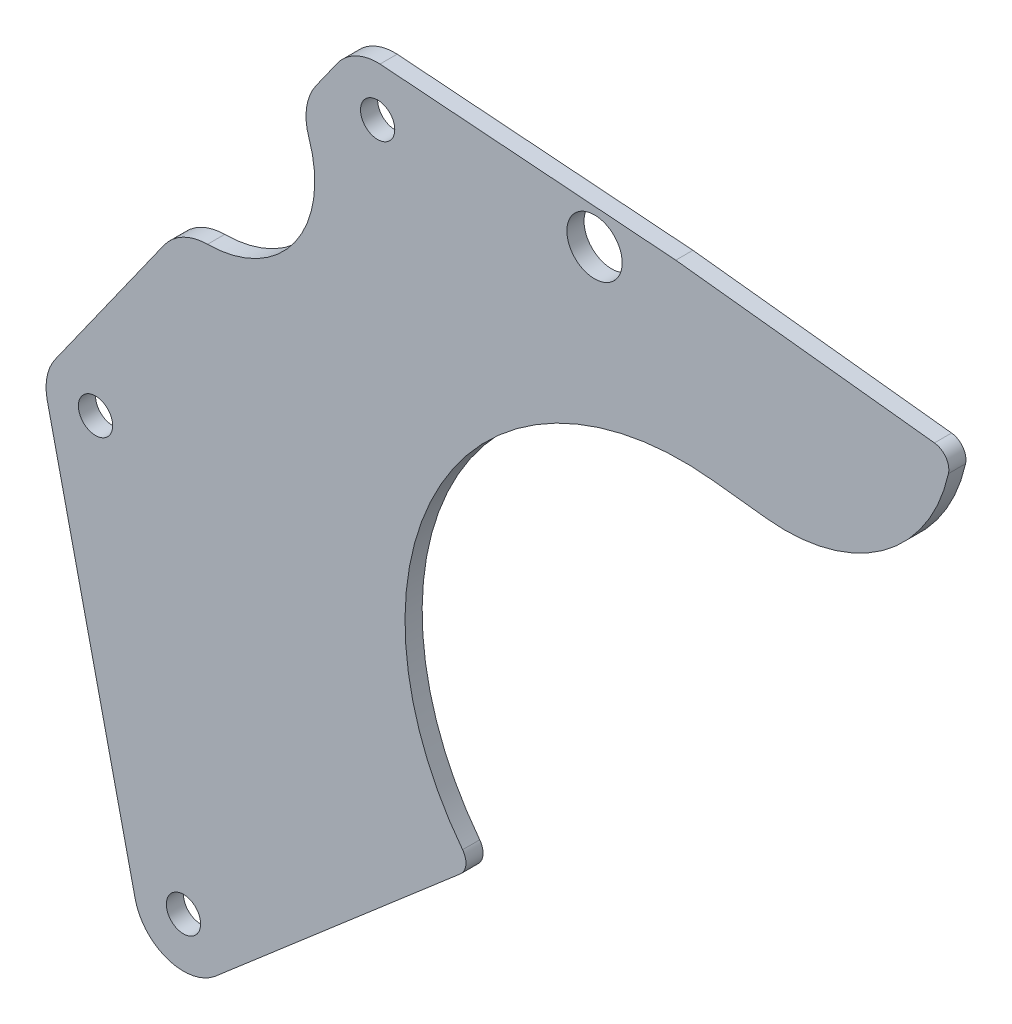
ISO-10303-21;
HEADER;
FILE_DESCRIPTION(('STEP AP214'),'2;1');
FILE_NAME('part.step','',(''),(''),'','','');
FILE_SCHEMA(('AUTOMOTIVE_DESIGN { 1 0 10303 214 1 1 1 1 }'));
ENDSEC;
DATA;
#1=APPLICATION_CONTEXT('core data for automotive mechanical design processes');
#2=APPLICATION_PROTOCOL_DEFINITION('international standard','automotive_design',2000,#1);
#3=PRODUCT_CONTEXT('',#1,'mechanical');
#4=PRODUCT('Part','Part','',(#3));
#5=PRODUCT_RELATED_PRODUCT_CATEGORY('part','',(#4));
#6=PRODUCT_DEFINITION_FORMATION('','',#4);
#7=PRODUCT_DEFINITION_CONTEXT('part definition',#1,'design');
#8=PRODUCT_DEFINITION('design','',#6,#7);
#9=PRODUCT_DEFINITION_SHAPE('','',#8);
#10=(LENGTH_UNIT() NAMED_UNIT(*) SI_UNIT(.MILLI.,.METRE.));
#11=(NAMED_UNIT(*) PLANE_ANGLE_UNIT() SI_UNIT($,.RADIAN.));
#12=(NAMED_UNIT(*) SI_UNIT($,.STERADIAN.) SOLID_ANGLE_UNIT());
#13=UNCERTAINTY_MEASURE_WITH_UNIT(LENGTH_MEASURE(1.E-05),#10,'distance_accuracy_value','');
#14=(GEOMETRIC_REPRESENTATION_CONTEXT(3) GLOBAL_UNCERTAINTY_ASSIGNED_CONTEXT((#13)) GLOBAL_UNIT_ASSIGNED_CONTEXT((#10,
#11,#12)) REPRESENTATION_CONTEXT('',''));
#15=CARTESIAN_POINT('',(0.,0.,0.));
#16=DIRECTION('',(0.,0.,1.));
#17=DIRECTION('',(1.,0.,0.));
#18=AXIS2_PLACEMENT_3D('',#15,#16,#17);
#19=CARTESIAN_POINT('',(-81.8369881821174,58.0921240925624,-3.175));
#20=DIRECTION('',(-0.815440069846838,0.578841508954034,0.));
#21=DIRECTION('',(-0.578841508954034,-0.815440069846838,0.));
#22=AXIS2_PLACEMENT_3D('',#19,#20,#21);
#23=PLANE('',#22);
#24=DIRECTION('',(-0.578841508954034,-0.815440069846838,0.));
#25=VECTOR('',#24,1.);
#26=CARTESIAN_POINT('',(-81.8369881821174,58.0921240925624,-3.175));
#27=LINE('',#26,#25);
#28=CARTESIAN_POINT('',(-63.9675027207216,83.265672028158,-3.175));
#29=VERTEX_POINT('',#28);
#30=CARTESIAN_POINT('',(-67.913524567669,77.7067335610367,-3.175));
#31=VERTEX_POINT('',#30);
#32=EDGE_CURVE('E229',#29,#31,#27,.T.);
#33=ORIENTED_EDGE('',*,*,#32,.T.);
#34=DIRECTION('',(0.,0.,1.));
#35=VECTOR('',#34,1.);
#36=CARTESIAN_POINT('',(-67.913524567669,77.7067335610367,0.));
#37=LINE('',#36,#35);
#38=CARTESIAN_POINT('',(-67.913524567669,77.7067335610367,0.));
#39=VERTEX_POINT('',#38);
#40=EDGE_CURVE('E67',#31,#39,#37,.T.);
#41=ORIENTED_EDGE('',*,*,#40,.T.);
#42=DIRECTION('',(-0.578841508954034,-0.815440069846838,0.));
#43=VECTOR('',#42,1.);
#44=CARTESIAN_POINT('',(-81.8369881821174,58.0921240925624,0.));
#45=LINE('',#44,#43);
#46=CARTESIAN_POINT('',(-63.9675027207216,83.265672028158,0.));
#47=VERTEX_POINT('',#46);
#48=EDGE_CURVE('E276',#47,#39,#45,.T.);
#49=ORIENTED_EDGE('',*,*,#48,.F.);
#50=DIRECTION('',(0.,0.,1.));
#51=VECTOR('',#50,1.);
#52=CARTESIAN_POINT('',(-63.9675027207216,83.265672028158,-3.175));
#53=LINE('',#52,#51);
#54=EDGE_CURVE('E316',#29,#47,#53,.T.);
#55=ORIENTED_EDGE('',*,*,#54,.F.);
#56=EDGE_LOOP('',(#33,#41,#49,#55));
#57=FACE_BOUND('',#56,.T.);
#58=ADVANCED_FACE('F43',(#57),#23,.T.);
#59=CARTESIAN_POINT('',(0.0073323484196218,0.0126999999984778,-3.175));
#60=DIRECTION('',(0.,0.,1.));
#61=DIRECTION('',(1.,0.,0.));
#62=AXIS2_PLACEMENT_3D('',#59,#60,#61);
#63=CYLINDRICAL_SURFACE('',#62,51.4198488537578);
#64=CARTESIAN_POINT('',(0.0073323484196218,0.0126999999984778,0.));
#65=DIRECTION('',(0.,0.,1.));
#66=DIRECTION('',(1.,0.,0.));
#67=AXIS2_PLACEMENT_3D('',#64,#65,#66);
#68=CIRCLE('',#67,51.4198488537578);
#69=CARTESIAN_POINT('',(5.71987005802179,51.1142437052494,0.));
#70=VERTEX_POINT('',#69);
#71=CARTESIAN_POINT('',(-40.7399952208334,-31.3505930686078,0.));
#72=VERTEX_POINT('',#71);
#73=EDGE_CURVE('E167',#70,#72,#68,.T.);
#74=ORIENTED_EDGE('',*,*,#73,.T.);
#75=DIRECTION('',(0.,0.,1.));
#76=VECTOR('',#75,1.);
#77=CARTESIAN_POINT('',(-40.7399952208334,-31.3505930686078,-3.175));
#78=LINE('',#77,#76);
#79=CARTESIAN_POINT('',(-40.7399952208334,-31.3505930686078,-3.175));
#80=VERTEX_POINT('',#79);
#81=EDGE_CURVE('E343',#72,#80,#78,.F.);
#82=ORIENTED_EDGE('',*,*,#81,.T.);
#83=CARTESIAN_POINT('',(0.0073323484196218,0.0126999999984778,-3.175));
#84=DIRECTION('',(0.,0.,1.));
#85=DIRECTION('',(1.,0.,0.));
#86=AXIS2_PLACEMENT_3D('',#83,#84,#85);
#87=CIRCLE('',#86,51.4198488537578);
#88=CARTESIAN_POINT('',(5.71987005802179,51.1142437052494,-3.175));
#89=VERTEX_POINT('',#88);
#90=EDGE_CURVE('E170',#89,#80,#87,.T.);
#91=ORIENTED_EDGE('',*,*,#90,.F.);
#92=DIRECTION('',(0.,0.,1.));
#93=VECTOR('',#92,1.);
#94=CARTESIAN_POINT('',(5.71987005802179,51.1142437052494,-3.175));
#95=LINE('',#94,#93);
#96=EDGE_CURVE('E164',#89,#70,#95,.T.);
#97=ORIENTED_EDGE('',*,*,#96,.T.);
#98=EDGE_LOOP('',(#74,#82,#91,#97));
#99=FACE_BOUND('',#98,.T.);
#100=ADVANCED_FACE('F166',(#99),#63,.F.);
#101=CARTESIAN_POINT('',(-0.00315637595907477,0.00366371212932346,-3.175));
#102=DIRECTION('',(-0.652702740656731,0.757614105161191,0.));
#103=DIRECTION('',(-0.757614105161192,-0.652702740656731,0.));
#104=AXIS2_PLACEMENT_3D('',#101,#102,#103);
#105=PLANE('',#104);
#106=DIRECTION('',(-0.757614105161191,-0.652702740656731,0.));
#107=VECTOR('',#106,1.);
#108=CARTESIAN_POINT('',(-0.00315637595907477,0.00366371212932346,-3.175));
#109=LINE('',#108,#107);
#110=CARTESIAN_POINT('',(-41.1592176490451,-35.4532711635278,-3.175));
#111=VERTEX_POINT('',#110);
#112=CARTESIAN_POINT('',(-86.6895047273987,-74.6787065883425,-3.175));
#113=VERTEX_POINT('',#112);
#114=EDGE_CURVE('E243',#111,#113,#109,.T.);
#115=ORIENTED_EDGE('',*,*,#114,.F.);
#116=DIRECTION('',(0.,0.,1.));
#117=VECTOR('',#116,1.);
#118=CARTESIAN_POINT('',(-41.1592176490451,-35.4532711635278,-3.175));
#119=LINE('',#118,#117);
#120=CARTESIAN_POINT('',(-41.1592176490451,-35.4532711635278,0.));
#121=VERTEX_POINT('',#120);
#122=EDGE_CURVE('E337',#111,#121,#119,.T.);
#123=ORIENTED_EDGE('',*,*,#122,.T.);
#124=DIRECTION('',(-0.757614105161191,-0.652702740656731,0.));
#125=VECTOR('',#124,1.);
#126=CARTESIAN_POINT('',(-0.00315637595907477,0.00366371212932346,0.));
#127=LINE('',#126,#125);
#128=CARTESIAN_POINT('',(-86.6895047273987,-74.6787065883425,0.));
#129=VERTEX_POINT('',#128);
#130=EDGE_CURVE('E188',#121,#129,#127,.T.);
#131=ORIENTED_EDGE('',*,*,#130,.T.);
#132=DIRECTION('',(0.,0.,1.));
#133=VECTOR('',#132,1.);
#134=CARTESIAN_POINT('',(-86.6895047273987,-74.6787065883425,-3.175));
#135=LINE('',#134,#133);
#136=EDGE_CURVE('E177',#113,#129,#135,.T.);
#137=ORIENTED_EDGE('',*,*,#136,.F.);
#138=EDGE_LOOP('',(#115,#123,#131,#137));
#139=FACE_BOUND('',#138,.T.);
#140=ADVANCED_FACE('F434',(#139),#105,.F.);
#141=CARTESIAN_POINT('',(-92.4756552296519,-67.558236985483,-3.175));
#142=DIRECTION('',(0.,0.,1.));
#143=DIRECTION('',(1.,0.,0.));
#144=AXIS2_PLACEMENT_3D('',#141,#142,#143);
#145=CYLINDRICAL_SURFACE('',#144,9.17499999999842);
#146=CARTESIAN_POINT('',(-92.4756552296519,-67.558236985483,0.));
#147=DIRECTION('',(0.,0.,1.));
#148=DIRECTION('',(1.,0.,0.));
#149=AXIS2_PLACEMENT_3D('',#146,#147,#148);
#150=CIRCLE('',#149,9.17499999999842);
#151=CARTESIAN_POINT('',(-101.423346554441,-69.5878785686907,0.));
#152=VERTEX_POINT('',#151);
#153=EDGE_CURVE('E287',#152,#129,#150,.T.);
#154=ORIENTED_EDGE('',*,*,#153,.F.);
#155=DIRECTION('',(0.,0.,1.));
#156=VECTOR('',#155,1.);
#157=CARTESIAN_POINT('',(-101.423346554441,-69.5878785686907,-3.175));
#158=LINE('',#157,#156);
#159=CARTESIAN_POINT('',(-101.423346554441,-69.5878785686907,-3.175));
#160=VERTEX_POINT('',#159);
#161=EDGE_CURVE('E306',#160,#152,#158,.T.);
#162=ORIENTED_EDGE('',*,*,#161,.F.);
#163=CARTESIAN_POINT('',(-92.4756552296519,-67.558236985483,-3.175));
#164=DIRECTION('',(0.,0.,1.));
#165=DIRECTION('',(1.,0.,0.));
#166=AXIS2_PLACEMENT_3D('',#163,#164,#165);
#167=CIRCLE('',#166,9.17499999999842);
#168=EDGE_CURVE('E239',#160,#113,#167,.T.);
#169=ORIENTED_EDGE('',*,*,#168,.T.);
#170=ORIENTED_EDGE('',*,*,#136,.T.);
#171=EDGE_LOOP('',(#154,#162,#169,#170));
#172=FACE_BOUND('',#171,.T.);
#173=ADVANCED_FACE('F446',(#172),#145,.T.);
#174=CARTESIAN_POINT('',(-111.472573185204,-25.2857817409333,-3.175));
#175=DIRECTION('',(0.975225212511119,0.221214341494044,0.));
#176=DIRECTION('',(-0.221214341494044,0.975225212511119,0.));
#177=AXIS2_PLACEMENT_3D('',#174,#175,#176);
#178=PLANE('',#177);
#179=DIRECTION('',(-0.221214341494044,0.975225212511119,0.));
#180=VECTOR('',#179,1.);
#181=CARTESIAN_POINT('',(-111.472573185204,-25.2857817409333,0.));
#182=LINE('',#181,#180);
#183=CARTESIAN_POINT('',(-117.721858194137,2.26424173276732,0.));
#184=VERTEX_POINT('',#183);
#185=EDGE_CURVE('E283',#152,#184,#182,.T.);
#186=ORIENTED_EDGE('',*,*,#185,.T.);
#187=DIRECTION('',(0.,0.,1.));
#188=VECTOR('',#187,1.);
#189=CARTESIAN_POINT('',(-117.721858194137,2.26424173276732,-3.175));
#190=LINE('',#189,#188);
#191=CARTESIAN_POINT('',(-117.721858194137,2.26424173276732,-3.175));
#192=VERTEX_POINT('',#191);
#193=EDGE_CURVE('E309',#192,#184,#190,.T.);
#194=ORIENTED_EDGE('',*,*,#193,.F.);
#195=DIRECTION('',(-0.221214341494044,0.975225212511119,0.));
#196=VECTOR('',#195,1.);
#197=CARTESIAN_POINT('',(-111.472573185204,-25.2857817409333,-3.175));
#198=LINE('',#197,#196);
#199=EDGE_CURVE('E236',#160,#192,#198,.T.);
#200=ORIENTED_EDGE('',*,*,#199,.F.);
#201=ORIENTED_EDGE('',*,*,#161,.T.);
#202=EDGE_LOOP('',(#186,#194,#200,#201));
#203=FACE_BOUND('',#202,.T.);
#204=ADVANCED_FACE('F421',(#203),#178,.F.);
#205=CARTESIAN_POINT('',(-108.774166869348,4.293883315975,-3.175));
#206=DIRECTION('',(0.,0.,1.));
#207=DIRECTION('',(1.,0.,0.));
#208=AXIS2_PLACEMENT_3D('',#205,#206,#207);
#209=CYLINDRICAL_SURFACE('',#208,9.17499999999842);
#210=CARTESIAN_POINT('',(-108.774166869348,4.293883315975,0.));
#211=DIRECTION('',(0.,0.,1.));
#212=DIRECTION('',(1.,0.,0.));
#213=AXIS2_PLACEMENT_3D('',#210,#211,#212);
#214=CIRCLE('',#213,9.17499999999842);
#215=CARTESIAN_POINT('',(-116.255829510192,9.6047541606278,0.));
#216=VERTEX_POINT('',#215);
#217=EDGE_CURVE('E279',#216,#184,#214,.T.);
#218=ORIENTED_EDGE('',*,*,#217,.F.);
#219=DIRECTION('',(0.,0.,1.));
#220=VECTOR('',#219,1.);
#221=CARTESIAN_POINT('',(-116.255829510192,9.6047541606278,-3.175));
#222=LINE('',#221,#220);
#223=CARTESIAN_POINT('',(-116.255829510192,9.6047541606278,-3.175));
#224=VERTEX_POINT('',#223);
#225=EDGE_CURVE('E312',#224,#216,#222,.T.);
#226=ORIENTED_EDGE('',*,*,#225,.F.);
#227=CARTESIAN_POINT('',(-108.774166869348,4.293883315975,-3.175));
#228=DIRECTION('',(0.,0.,1.));
#229=DIRECTION('',(1.,0.,0.));
#230=AXIS2_PLACEMENT_3D('',#227,#228,#229);
#231=CIRCLE('',#230,9.17499999999842);
#232=EDGE_CURVE('E232',#224,#192,#231,.T.);
#233=ORIENTED_EDGE('',*,*,#232,.T.);
#234=ORIENTED_EDGE('',*,*,#193,.T.);
#235=EDGE_LOOP('',(#218,#226,#233,#234));
#236=FACE_BOUND('',#235,.T.);
#237=ADVANCED_FACE('F416',(#236),#209,.T.);
#238=CARTESIAN_POINT('',(-96.1120634913359,37.982183414237,0.));
#239=VERTEX_POINT('',#238);
#240=EDGE_CURVE('E275',#239,#216,#45,.T.);
#241=ORIENTED_EDGE('',*,*,#240,.F.);
#242=DIRECTION('',(0.,0.,1.));
#243=VECTOR('',#242,1.);
#244=CARTESIAN_POINT('',(-96.1120634913359,37.982183414237,-3.175));
#245=LINE('',#244,#243);
#246=CARTESIAN_POINT('',(-96.1120634913359,37.982183414237,-3.175));
#247=VERTEX_POINT('',#246);
#248=EDGE_CURVE('E11',#239,#247,#245,.F.);
#249=ORIENTED_EDGE('',*,*,#248,.T.);
#250=EDGE_CURVE('E228',#247,#224,#27,.T.);
#251=ORIENTED_EDGE('',*,*,#250,.T.);
#252=ORIENTED_EDGE('',*,*,#225,.T.);
#253=EDGE_LOOP('',(#241,#249,#251,#252));
#254=FACE_BOUND('',#253,.T.);
#255=ADVANCED_FACE('F410',(#254),#23,.T.);
#256=CARTESIAN_POINT('',(-56.4858400798775,77.9548011835051,-3.175));
#257=DIRECTION('',(0.,0.,1.));
#258=DIRECTION('',(1.,0.,0.));
#259=AXIS2_PLACEMENT_3D('',#256,#257,#258);
#260=CYLINDRICAL_SURFACE('',#259,9.17499999999841);
#261=CARTESIAN_POINT('',(-56.4858400798775,77.9548011835051,0.));
#262=DIRECTION('',(0.,0.,1.));
#263=DIRECTION('',(1.,0.,0.));
#264=AXIS2_PLACEMENT_3D('',#261,#262,#263);
#265=CIRCLE('',#264,9.17499999999841);
#266=CARTESIAN_POINT('',(-56.039685463714,87.1189471370829,0.));
#267=VERTEX_POINT('',#266);
#268=EDGE_CURVE('E271',#267,#47,#265,.T.);
#269=ORIENTED_EDGE('',*,*,#268,.F.);
#270=DIRECTION('',(0.,0.,1.));
#271=VECTOR('',#270,1.);
#272=CARTESIAN_POINT('',(-56.039685463714,87.1189471370829,-3.175));
#273=LINE('',#272,#271);
#274=CARTESIAN_POINT('',(-56.039685463714,87.1189471370829,-3.175));
#275=VERTEX_POINT('',#274);
#276=EDGE_CURVE('E319',#275,#267,#273,.T.);
#277=ORIENTED_EDGE('',*,*,#276,.F.);
#278=CARTESIAN_POINT('',(-56.4858400798775,77.9548011835051,-3.175));
#279=DIRECTION('',(0.,0.,1.));
#280=DIRECTION('',(1.,0.,0.));
#281=AXIS2_PLACEMENT_3D('',#278,#279,#280);
#282=CIRCLE('',#281,9.17499999999841);
#283=EDGE_CURVE('E224',#275,#29,#282,.T.);
#284=ORIENTED_EDGE('',*,*,#283,.T.);
#285=ORIENTED_EDGE('',*,*,#54,.T.);
#286=EDGE_LOOP('',(#269,#277,#284,#285));
#287=FACE_BOUND('',#286,.T.);
#288=ADVANCED_FACE('F386',(#287),#260,.T.);
#289=CARTESIAN_POINT('',(6.13658667931134,82.493747083869,-3.175));
#290=DIRECTION('',(-0.0741835372646384,-0.997244605299475,0.));
#291=DIRECTION('',(0.997244605299475,-0.0741835372646384,0.));
#292=AXIS2_PLACEMENT_3D('',#289,#290,#291);
#293=PLANE('',#292);
#294=DIRECTION('',(0.997244605299475,-0.0741835372646384,0.));
#295=VECTOR('',#294,1.);
#296=CARTESIAN_POINT('',(6.13658667931134,82.493747083869,0.));
#297=LINE('',#296,#295);
#298=CARTESIAN_POINT('',(-1.22605759265222,83.0414431985564,0.));
#299=VERTEX_POINT('',#298);
#300=EDGE_CURVE('E268',#267,#299,#297,.T.);
#301=ORIENTED_EDGE('',*,*,#300,.T.);
#302=DIRECTION('',(0.,0.,1.));
#303=VECTOR('',#302,1.);
#304=CARTESIAN_POINT('',(-1.22605759265222,83.0414431985564,-3.175));
#305=LINE('',#304,#303);
#306=CARTESIAN_POINT('',(-1.22605759265222,83.0414431985564,-3.175));
#307=VERTEX_POINT('',#306);
#308=EDGE_CURVE('E260',#307,#299,#305,.T.);
#309=ORIENTED_EDGE('',*,*,#308,.F.);
#310=DIRECTION('',(0.997244605299475,-0.0741835372646384,0.));
#311=VECTOR('',#310,1.);
#312=CARTESIAN_POINT('',(6.13658667931134,82.493747083869,-3.175));
#313=LINE('',#312,#311);
#314=EDGE_CURVE('E221',#275,#307,#313,.T.);
#315=ORIENTED_EDGE('',*,*,#314,.F.);
#316=ORIENTED_EDGE('',*,*,#276,.T.);
#317=EDGE_LOOP('',(#301,#309,#315,#316));
#318=FACE_BOUND('',#317,.T.);
#319=ADVANCED_FACE('F392',(#318),#293,.F.);
#320=CARTESIAN_POINT('',(-108.774166869348,4.293883315975,-3.175));
#321=DIRECTION('',(0.,0.,1.));
#322=DIRECTION('',(1.,0.,0.));
#323=AXIS2_PLACEMENT_3D('',#320,#321,#322);
#324=CYLINDRICAL_SURFACE('',#323,3.17499999999841);
#325=CARTESIAN_POINT('',(-108.774166869348,4.293883315975,-3.175));
#326=DIRECTION('',(0.,0.,1.));
#327=DIRECTION('',(1.,0.,0.));
#328=AXIS2_PLACEMENT_3D('',#325,#326,#327);
#329=CIRCLE('',#328,3.17499999999841);
#330=CARTESIAN_POINT('',(-105.59916686935,4.293883315975,-3.175));
#331=VERTEX_POINT('',#330);
#332=EDGE_CURVE('E252',#331,#331,#329,.T.);
#333=ORIENTED_EDGE('',*,*,#332,.F.);
#334=EDGE_LOOP('',(#333));
#335=FACE_BOUND('',#334,.T.);
#336=CARTESIAN_POINT('',(-108.774166869348,4.293883315975,0.));
#337=DIRECTION('',(0.,0.,1.));
#338=DIRECTION('',(1.,0.,0.));
#339=AXIS2_PLACEMENT_3D('',#336,#337,#338);
#340=CIRCLE('',#339,3.17499999999841);
#341=CARTESIAN_POINT('',(-105.59916686935,4.293883315975,0.));
#342=VERTEX_POINT('',#341);
#343=EDGE_CURVE('E296',#342,#342,#340,.T.);
#344=ORIENTED_EDGE('',*,*,#343,.T.);
#345=EDGE_LOOP('',(#344));
#346=FACE_BOUND('',#345,.T.);
#347=ADVANCED_FACE('F458',(#335,#346),#324,.F.);
#348=CARTESIAN_POINT('',(-92.4756552296519,-67.558236985483,-3.175));
#349=DIRECTION('',(0.,0.,1.));
#350=DIRECTION('',(1.,0.,0.));
#351=AXIS2_PLACEMENT_3D('',#348,#349,#350);
#352=CYLINDRICAL_SURFACE('',#351,3.17499999999842);
#353=CARTESIAN_POINT('',(-92.4756552296519,-67.558236985483,-3.175));
#354=DIRECTION('',(0.,0.,1.));
#355=DIRECTION('',(1.,0.,0.));
#356=AXIS2_PLACEMENT_3D('',#353,#354,#355);
#357=CIRCLE('',#356,3.17499999999842);
#358=CARTESIAN_POINT('',(-89.3006552296535,-67.558236985483,-3.175));
#359=VERTEX_POINT('',#358);
#360=EDGE_CURVE('E248',#359,#359,#357,.T.);
#361=ORIENTED_EDGE('',*,*,#360,.F.);
#362=EDGE_LOOP('',(#361));
#363=FACE_BOUND('',#362,.T.);
#364=CARTESIAN_POINT('',(-92.4756552296519,-67.558236985483,0.));
#365=DIRECTION('',(0.,0.,1.));
#366=DIRECTION('',(1.,0.,0.));
#367=AXIS2_PLACEMENT_3D('',#364,#365,#366);
#368=CIRCLE('',#367,3.17499999999842);
#369=CARTESIAN_POINT('',(-89.3006552296535,-67.558236985483,0.));
#370=VERTEX_POINT('',#369);
#371=EDGE_CURVE('E187',#370,#370,#368,.T.);
#372=ORIENTED_EDGE('',*,*,#371,.T.);
#373=EDGE_LOOP('',(#372));
#374=FACE_BOUND('',#373,.T.);
#375=ADVANCED_FACE('F455',(#363,#374),#352,.F.);
#376=CARTESIAN_POINT('',(9.15332765430292,81.8811528173555,-3.175));
#377=DIRECTION('',(-0.111095964631267,-0.993809683310969,0.));
#378=DIRECTION('',(0.993809683310969,-0.111095964631267,0.));
#379=AXIS2_PLACEMENT_3D('',#376,#377,#378);
#380=PLANE('',#379);
#381=DIRECTION('',(0.993809683310969,-0.111095964631267,0.));
#382=VECTOR('',#381,1.);
#383=CARTESIAN_POINT('',(9.15332765430292,81.8811528173555,0.));
#384=LINE('',#383,#382);
#385=CARTESIAN_POINT('',(46.7216683378149,77.681464368028,0.));
#386=VERTEX_POINT('',#385);
#387=EDGE_CURVE('E264',#299,#386,#384,.T.);
#388=ORIENTED_EDGE('',*,*,#387,.T.);
#389=DIRECTION('',(0.,0.,-1.));
#390=VECTOR('',#389,1.);
#391=CARTESIAN_POINT('',(46.7216683378149,77.681464368028,-3.175));
#392=LINE('',#391,#390);
#393=CARTESIAN_POINT('',(46.7216683378149,77.681464368028,-3.175));
#394=VERTEX_POINT('',#393);
#395=EDGE_CURVE('E331',#386,#394,#392,.T.);
#396=ORIENTED_EDGE('',*,*,#395,.T.);
#397=DIRECTION('',(0.993809683310969,-0.111095964631267,0.));
#398=VECTOR('',#397,1.);
#399=CARTESIAN_POINT('',(9.15332765430292,81.8811528173555,-3.175));
#400=LINE('',#399,#398);
#401=EDGE_CURVE('E216',#307,#394,#400,.T.);
#402=ORIENTED_EDGE('',*,*,#401,.F.);
#403=ORIENTED_EDGE('',*,*,#308,.T.);
#404=EDGE_LOOP('',(#388,#396,#402,#403));
#405=FACE_BOUND('',#404,.T.);
#406=ADVANCED_FACE('F396',(#405),#380,.F.);
#407=CARTESIAN_POINT('',(-16.2857242010293,77.6467656296303,-3.175));
#408=DIRECTION('',(0.,0.,1.));
#409=DIRECTION('',(1.,0.,0.));
#410=AXIS2_PLACEMENT_3D('',#407,#408,#409);
#411=CYLINDRICAL_SURFACE('',#410,5.12499999999842);
#412=CARTESIAN_POINT('',(-16.2857242010293,77.6467656296303,-3.175));
#413=DIRECTION('',(0.,0.,1.));
#414=DIRECTION('',(1.,0.,0.));
#415=AXIS2_PLACEMENT_3D('',#412,#413,#414);
#416=CIRCLE('',#415,5.12499999999842);
#417=CARTESIAN_POINT('',(-11.1607242010309,77.6467656296303,-3.175));
#418=VERTEX_POINT('',#417);
#419=EDGE_CURVE('E212',#418,#418,#416,.T.);
#420=ORIENTED_EDGE('',*,*,#419,.F.);
#421=EDGE_LOOP('',(#420));
#422=FACE_BOUND('',#421,.T.);
#423=CARTESIAN_POINT('',(-16.2857242010293,77.6467656296303,0.));
#424=DIRECTION('',(0.,0.,1.));
#425=DIRECTION('',(1.,0.,0.));
#426=AXIS2_PLACEMENT_3D('',#423,#424,#425);
#427=CIRCLE('',#426,5.12499999999842);
#428=CARTESIAN_POINT('',(-11.1607242010309,77.6467656296303,0.));
#429=VERTEX_POINT('',#428);
#430=EDGE_CURVE('E211',#429,#429,#427,.T.);
#431=ORIENTED_EDGE('',*,*,#430,.T.);
#432=EDGE_LOOP('',(#431));
#433=FACE_BOUND('',#432,.T.);
#434=ADVANCED_FACE('F466',(#422,#433),#411,.F.);
#435=CARTESIAN_POINT('',(-56.4858400798775,77.9548011835051,-3.175));
#436=DIRECTION('',(0.,0.,1.));
#437=DIRECTION('',(1.,0.,0.));
#438=AXIS2_PLACEMENT_3D('',#435,#436,#437);
#439=CYLINDRICAL_SURFACE('',#438,3.17499999999841);
#440=CARTESIAN_POINT('',(-56.4858400798775,77.9548011835051,-3.175));
#441=DIRECTION('',(0.,0.,1.));
#442=DIRECTION('',(1.,0.,0.));
#443=AXIS2_PLACEMENT_3D('',#440,#441,#442);
#444=CIRCLE('',#443,3.17499999999841);
#445=CARTESIAN_POINT('',(-53.3108400798791,77.9548011835051,-3.175));
#446=VERTEX_POINT('',#445);
#447=EDGE_CURVE('E256',#446,#446,#444,.T.);
#448=ORIENTED_EDGE('',*,*,#447,.F.);
#449=EDGE_LOOP('',(#448));
#450=FACE_BOUND('',#449,.T.);
#451=CARTESIAN_POINT('',(-56.4858400798775,77.9548011835051,0.));
#452=DIRECTION('',(0.,0.,1.));
#453=DIRECTION('',(1.,0.,0.));
#454=AXIS2_PLACEMENT_3D('',#451,#452,#453);
#455=CIRCLE('',#454,3.17499999999841);
#456=CARTESIAN_POINT('',(-53.3108400798791,77.9548011835051,0.));
#457=VERTEX_POINT('',#456);
#458=EDGE_CURVE('E217',#457,#457,#455,.T.);
#459=ORIENTED_EDGE('',*,*,#458,.T.);
#460=EDGE_LOOP('',(#459));
#461=FACE_BOUND('',#460,.T.);
#462=ADVANCED_FACE('F463',(#450,#461),#439,.F.);
#463=CARTESIAN_POINT('',(0.,0.,-3.175));
#464=DIRECTION('',(0.,0.,1.));
#465=DIRECTION('',(1.,0.,0.));
#466=AXIS2_PLACEMENT_3D('',#463,#464,#465);
#467=PLANE('',#466);
#468=ORIENTED_EDGE('',*,*,#419,.T.);
#469=EDGE_LOOP('',(#468));
#470=FACE_BOUND('',#469,.T.);
#471=CARTESIAN_POINT('',(-88.139089590994,62.1932197249627,-3.175));
#472=DIRECTION('',(0.,0.,-1.));
#473=DIRECTION('',(-1.,0.,0.));
#474=AXIS2_PLACEMENT_3D('',#471,#472,#473);
#475=CIRCLE('',#474,20.);
#476=CARTESIAN_POINT('',(-69.2191124431317,68.6766188893185,-3.175));
#477=VERTEX_POINT('',#476);
#478=CARTESIAN_POINT('',(-88.018138392243,42.1935854581187,-3.175));
#479=VERTEX_POINT('',#478);
#480=EDGE_CURVE('E196',#477,#479,#475,.T.);
#481=ORIENTED_EDGE('',*,*,#480,.F.);
#482=CARTESIAN_POINT('',(-59.7591238692006,71.9183184714964,-3.175));
#483=DIRECTION('',(0.,0.,1.));
#484=DIRECTION('',(1.,0.,0.));
#485=AXIS2_PLACEMENT_3D('',#482,#483,#484);
#486=CIRCLE('',#485,10.);
#487=EDGE_CURVE('E364',#477,#31,#486,.F.);
#488=ORIENTED_EDGE('',*,*,#487,.T.);
#489=ORIENTED_EDGE('',*,*,#32,.F.);
#490=ORIENTED_EDGE('',*,*,#283,.F.);
#491=ORIENTED_EDGE('',*,*,#314,.T.);
#492=ORIENTED_EDGE('',*,*,#401,.T.);
#493=CARTESIAN_POINT('',(46.3883804439211,74.7000353180951,-3.175));
#494=DIRECTION('',(0.,0.,1.));
#495=DIRECTION('',(1.,0.,0.));
#496=AXIS2_PLACEMENT_3D('',#493,#494,#495);
#497=CIRCLE('',#496,3.);
#498=CARTESIAN_POINT('',(49.3168322266116,74.0487518495062,-3.175));
#499=VERTEX_POINT('',#498);
#500=EDGE_CURVE('E334',#394,#499,#497,.F.);
#501=ORIENTED_EDGE('',*,*,#500,.T.);
#502=CARTESIAN_POINT('',(19.0972641529712,80.7695403666989,-3.175));
#503=DIRECTION('',(0.,0.,1.));
#504=DIRECTION('',(1.,0.,0.));
#505=AXIS2_PLACEMENT_3D('',#502,#503,#504);
#506=CIRCLE('',#505,30.957895484839);
#507=CARTESIAN_POINT('',(15.6579668911291,50.003284058937,-3.175));
#508=VERTEX_POINT('',#507);
#509=EDGE_CURVE('E204',#499,#508,#506,.F.);
#510=ORIENTED_EDGE('',*,*,#509,.T.);
#511=DIRECTION('',(-0.993809683310969,0.111095964631265,0.));
#512=VECTOR('',#511,1.);
#513=CARTESIAN_POINT('',(5.71403039246068,51.1148965095936,-3.175));
#514=LINE('',#513,#512);
#515=EDGE_CURVE('E208',#508,#89,#514,.T.);
#516=ORIENTED_EDGE('',*,*,#515,.T.);
#517=ORIENTED_EDGE('',*,*,#90,.T.);
#518=CARTESIAN_POINT('',(-43.1173258710153,-33.1804288480442,-3.175));
#519=DIRECTION('',(0.,0.,1.));
#520=DIRECTION('',(1.,0.,0.));
#521=AXIS2_PLACEMENT_3D('',#518,#519,#520);
#522=CIRCLE('',#521,3.);
#523=EDGE_CURVE('E346',#80,#111,#522,.F.);
#524=ORIENTED_EDGE('',*,*,#523,.T.);
#525=ORIENTED_EDGE('',*,*,#114,.T.);
#526=ORIENTED_EDGE('',*,*,#168,.F.);
#527=ORIENTED_EDGE('',*,*,#199,.T.);
#528=ORIENTED_EDGE('',*,*,#232,.F.);
#529=ORIENTED_EDGE('',*,*,#250,.F.);
#530=CARTESIAN_POINT('',(-87.9576627928675,32.1937683246967,-3.175));
#531=DIRECTION('',(0.,0.,1.));
#532=DIRECTION('',(1.,0.,0.));
#533=AXIS2_PLACEMENT_3D('',#530,#531,#532);
#534=CIRCLE('',#533,10.);
#535=EDGE_CURVE('E361',#247,#479,#534,.F.);
#536=ORIENTED_EDGE('',*,*,#535,.T.);
#537=EDGE_LOOP('',(#481,#488,#489,#490,#491,#492,#501,#510,#516,#517,#524,#525,#526,#527,#528,
#529,#536));
#538=FACE_BOUND('',#537,.T.);
#539=ORIENTED_EDGE('',*,*,#360,.T.);
#540=EDGE_LOOP('',(#539));
#541=FACE_BOUND('',#540,.T.);
#542=ORIENTED_EDGE('',*,*,#332,.T.);
#543=EDGE_LOOP('',(#542));
#544=FACE_BOUND('',#543,.T.);
#545=ORIENTED_EDGE('',*,*,#447,.T.);
#546=EDGE_LOOP('',(#545));
#547=FACE_BOUND('',#546,.T.);
#548=ADVANCED_FACE('F381',(#470,#538,#541,#544,#547),#467,.F.);
#549=CARTESIAN_POINT('',(0.,0.,0.));
#550=DIRECTION('',(0.,0.,1.));
#551=DIRECTION('',(1.,0.,0.));
#552=AXIS2_PLACEMENT_3D('',#549,#550,#551);
#553=PLANE('',#552);
#554=ORIENTED_EDGE('',*,*,#48,.T.);
#555=CARTESIAN_POINT('',(-59.7591238692006,71.9183184714964,0.));
#556=DIRECTION('',(0.,0.,1.));
#557=DIRECTION('',(1.,0.,0.));
#558=AXIS2_PLACEMENT_3D('',#555,#556,#557);
#559=CIRCLE('',#558,10.);
#560=CARTESIAN_POINT('',(-69.2191124431317,68.6766188893185,0.));
#561=VERTEX_POINT('',#560);
#562=EDGE_CURVE('E52',#39,#561,#559,.T.);
#563=ORIENTED_EDGE('',*,*,#562,.T.);
#564=CARTESIAN_POINT('',(-88.139089590994,62.1932197249627,0.));
#565=DIRECTION('',(0.,0.,1.));
#566=DIRECTION('',(1.,0.,0.));
#567=AXIS2_PLACEMENT_3D('',#564,#565,#566);
#568=CIRCLE('',#567,20.);
#569=CARTESIAN_POINT('',(-88.018138392243,42.1935854581187,0.));
#570=VERTEX_POINT('',#569);
#571=EDGE_CURVE('E349',#570,#561,#568,.T.);
#572=ORIENTED_EDGE('',*,*,#571,.F.);
#573=CARTESIAN_POINT('',(-87.9576627928675,32.1937683246967,0.));
#574=DIRECTION('',(0.,0.,1.));
#575=DIRECTION('',(1.,0.,0.));
#576=AXIS2_PLACEMENT_3D('',#573,#574,#575);
#577=CIRCLE('',#576,10.);
#578=EDGE_CURVE('E59',#570,#239,#577,.T.);
#579=ORIENTED_EDGE('',*,*,#578,.T.);
#580=ORIENTED_EDGE('',*,*,#240,.T.);
#581=ORIENTED_EDGE('',*,*,#217,.T.);
#582=ORIENTED_EDGE('',*,*,#185,.F.);
#583=ORIENTED_EDGE('',*,*,#153,.T.);
#584=ORIENTED_EDGE('',*,*,#130,.F.);
#585=CARTESIAN_POINT('',(-43.1173258710153,-33.1804288480442,0.));
#586=DIRECTION('',(0.,0.,1.));
#587=DIRECTION('',(1.,0.,0.));
#588=AXIS2_PLACEMENT_3D('',#585,#586,#587);
#589=CIRCLE('',#588,3.);
#590=EDGE_CURVE('E185',#121,#72,#589,.T.);
#591=ORIENTED_EDGE('',*,*,#590,.T.);
#592=ORIENTED_EDGE('',*,*,#73,.F.);
#593=DIRECTION('',(0.993809683310969,-0.111095964631265,0.));
#594=VECTOR('',#593,1.);
#595=CARTESIAN_POINT('',(5.71403039246068,51.1148965095936,0.));
#596=LINE('',#595,#594);
#597=CARTESIAN_POINT('',(15.6579668911291,50.003284058937,0.));
#598=VERTEX_POINT('',#597);
#599=EDGE_CURVE('E183',#70,#598,#596,.T.);
#600=ORIENTED_EDGE('',*,*,#599,.T.);
#601=CARTESIAN_POINT('',(19.0972641529712,80.7695403666989,0.));
#602=DIRECTION('',(0.,0.,1.));
#603=DIRECTION('',(1.,0.,0.));
#604=AXIS2_PLACEMENT_3D('',#601,#602,#603);
#605=CIRCLE('',#604,30.957895484839);
#606=CARTESIAN_POINT('',(49.3168322266116,74.0487518495062,0.));
#607=VERTEX_POINT('',#606);
#608=EDGE_CURVE('E195',#598,#607,#605,.T.);
#609=ORIENTED_EDGE('',*,*,#608,.T.);
#610=CARTESIAN_POINT('',(46.3883804439211,74.7000353180951,0.));
#611=DIRECTION('',(0.,0.,1.));
#612=DIRECTION('',(1.,0.,0.));
#613=AXIS2_PLACEMENT_3D('',#610,#611,#612);
#614=CIRCLE('',#613,3.);
#615=EDGE_CURVE('E328',#607,#386,#614,.T.);
#616=ORIENTED_EDGE('',*,*,#615,.T.);
#617=ORIENTED_EDGE('',*,*,#387,.F.);
#618=ORIENTED_EDGE('',*,*,#300,.F.);
#619=ORIENTED_EDGE('',*,*,#268,.T.);
#620=EDGE_LOOP('',(#554,#563,#572,#579,#580,#581,#582,#583,#584,#591,#592,#600,#609,#616,#617,
#618,#619));
#621=FACE_BOUND('',#620,.T.);
#622=ORIENTED_EDGE('',*,*,#430,.F.);
#623=EDGE_LOOP('',(#622));
#624=FACE_BOUND('',#623,.T.);
#625=ORIENTED_EDGE('',*,*,#371,.F.);
#626=EDGE_LOOP('',(#625));
#627=FACE_BOUND('',#626,.T.);
#628=ORIENTED_EDGE('',*,*,#343,.F.);
#629=EDGE_LOOP('',(#628));
#630=FACE_BOUND('',#629,.T.);
#631=ORIENTED_EDGE('',*,*,#458,.F.);
#632=EDGE_LOOP('',(#631));
#633=FACE_BOUND('',#632,.T.);
#634=ADVANCED_FACE('F180',(#621,#624,#627,#630,#633),#553,.T.);
#635=CARTESIAN_POINT('',(19.0972641529712,80.7695403666989,-57.7375635422271));
#636=DIRECTION('',(0.,0.,1.));
#637=DIRECTION('',(1.,0.,0.));
#638=AXIS2_PLACEMENT_3D('',#635,#636,#637);
#639=CYLINDRICAL_SURFACE('',#638,30.957895484839);
#640=ORIENTED_EDGE('',*,*,#509,.F.);
#641=DIRECTION('',(0.,0.,1.));
#642=VECTOR('',#641,1.);
#643=CARTESIAN_POINT('',(49.3168322266116,74.0487518495062,-57.7375635422271));
#644=LINE('',#643,#642);
#645=EDGE_CURVE('E176',#499,#607,#644,.T.);
#646=ORIENTED_EDGE('',*,*,#645,.T.);
#647=ORIENTED_EDGE('',*,*,#608,.F.);
#648=DIRECTION('',(0.,0.,1.));
#649=VECTOR('',#648,1.);
#650=CARTESIAN_POINT('',(15.6579668911291,50.003284058937,-57.7375635422271));
#651=LINE('',#650,#649);
#652=EDGE_CURVE('E192',#508,#598,#651,.T.);
#653=ORIENTED_EDGE('',*,*,#652,.F.);
#654=EDGE_LOOP('',(#640,#646,#647,#653));
#655=FACE_BOUND('',#654,.T.);
#656=ADVANCED_FACE('F403',(#655),#639,.T.);
#657=CARTESIAN_POINT('',(5.71403039246068,51.1148965095936,-57.7375635422271));
#658=DIRECTION('',(-0.111095964631265,-0.993809683310969,0.));
#659=DIRECTION('',(0.993809683310969,-0.111095964631265,0.));
#660=AXIS2_PLACEMENT_3D('',#657,#658,#659);
#661=PLANE('',#660);
#662=ORIENTED_EDGE('',*,*,#515,.F.);
#663=ORIENTED_EDGE('',*,*,#652,.T.);
#664=ORIENTED_EDGE('',*,*,#599,.F.);
#665=ORIENTED_EDGE('',*,*,#96,.F.);
#666=EDGE_LOOP('',(#662,#663,#664,#665));
#667=FACE_BOUND('',#666,.T.);
#668=ADVANCED_FACE('F190',(#667),#661,.T.);
#669=CARTESIAN_POINT('',(46.3883804439211,74.7000353180951,-57.7375635422271));
#670=DIRECTION('',(0.,0.,1.));
#671=DIRECTION('',(1.,0.,0.));
#672=AXIS2_PLACEMENT_3D('',#669,#670,#671);
#673=CYLINDRICAL_SURFACE('',#672,3.);
#674=ORIENTED_EDGE('',*,*,#500,.F.);
#675=ORIENTED_EDGE('',*,*,#395,.F.);
#676=ORIENTED_EDGE('',*,*,#615,.F.);
#677=ORIENTED_EDGE('',*,*,#645,.F.);
#678=EDGE_LOOP('',(#674,#675,#676,#677));
#679=FACE_BOUND('',#678,.T.);
#680=ADVANCED_FACE('F399',(#679),#673,.T.);
#681=CARTESIAN_POINT('',(-43.1173258710153,-33.1804288480442,-3.175));
#682=DIRECTION('',(0.,0.,1.));
#683=DIRECTION('',(1.,0.,0.));
#684=AXIS2_PLACEMENT_3D('',#681,#682,#683);
#685=CYLINDRICAL_SURFACE('',#684,3.);
#686=ORIENTED_EDGE('',*,*,#523,.F.);
#687=ORIENTED_EDGE('',*,*,#81,.F.);
#688=ORIENTED_EDGE('',*,*,#590,.F.);
#689=ORIENTED_EDGE('',*,*,#122,.F.);
#690=EDGE_LOOP('',(#686,#687,#688,#689));
#691=FACE_BOUND('',#690,.T.);
#692=ADVANCED_FACE('F478',(#691),#685,.T.);
#693=CARTESIAN_POINT('',(-88.139089590994,62.1932197249627,6.825));
#694=DIRECTION('',(0.,0.,-1.));
#695=DIRECTION('',(-1.,0.,0.));
#696=AXIS2_PLACEMENT_3D('',#693,#694,#695);
#697=CYLINDRICAL_SURFACE('',#696,20.);
#698=ORIENTED_EDGE('',*,*,#571,.T.);
#699=DIRECTION('',(0.,0.,-1.));
#700=VECTOR('',#699,1.);
#701=CARTESIAN_POINT('',(-69.2191124431317,68.6766188893185,6.825));
#702=LINE('',#701,#700);
#703=EDGE_CURVE('E357',#561,#477,#702,.T.);
#704=ORIENTED_EDGE('',*,*,#703,.T.);
#705=ORIENTED_EDGE('',*,*,#480,.T.);
#706=DIRECTION('',(0.,0.,-1.));
#707=VECTOR('',#706,1.);
#708=CARTESIAN_POINT('',(-88.018138392243,42.1935854581187,6.825));
#709=LINE('',#708,#707);
#710=EDGE_CURVE('E353',#479,#570,#709,.F.);
#711=ORIENTED_EDGE('',*,*,#710,.T.);
#712=EDGE_LOOP('',(#698,#704,#705,#711));
#713=FACE_BOUND('',#712,.T.);
#714=ADVANCED_FACE('F375',(#713),#697,.F.);
#715=CARTESIAN_POINT('',(-59.7591238692006,71.9183184714964,6.825));
#716=DIRECTION('',(0.,0.,-1.));
#717=DIRECTION('',(-1.,0.,0.));
#718=AXIS2_PLACEMENT_3D('',#715,#716,#717);
#719=CYLINDRICAL_SURFACE('',#718,10.);
#720=ORIENTED_EDGE('',*,*,#562,.F.);
#721=ORIENTED_EDGE('',*,*,#40,.F.);
#722=ORIENTED_EDGE('',*,*,#487,.F.);
#723=ORIENTED_EDGE('',*,*,#703,.F.);
#724=EDGE_LOOP('',(#720,#721,#722,#723));
#725=FACE_BOUND('',#724,.T.);
#726=ADVANCED_FACE('F378',(#725),#719,.T.);
#727=CARTESIAN_POINT('',(-87.9576627928675,32.1937683246967,6.825));
#728=DIRECTION('',(0.,0.,-1.));
#729=DIRECTION('',(-1.,0.,0.));
#730=AXIS2_PLACEMENT_3D('',#727,#728,#729);
#731=CYLINDRICAL_SURFACE('',#730,10.);
#732=ORIENTED_EDGE('',*,*,#535,.F.);
#733=ORIENTED_EDGE('',*,*,#248,.F.);
#734=ORIENTED_EDGE('',*,*,#578,.F.);
#735=ORIENTED_EDGE('',*,*,#710,.F.);
#736=EDGE_LOOP('',(#732,#733,#734,#735));
#737=FACE_BOUND('',#736,.T.);
#738=ADVANCED_FACE('F45',(#737),#731,.T.);
#739=CLOSED_SHELL('',(#58,#100,#140,#173,#204,#237,#255,#288,#319,#347,#375,#406,#434,#462,#548,
#634,#656,#668,#680,#692,#714,#726,#738));
#740=MANIFOLD_SOLID_BREP('B2',#739);
#741=ADVANCED_BREP_SHAPE_REPRESENTATION('',(#18,#740),#14);
#742=SHAPE_DEFINITION_REPRESENTATION(#9,#741);
ENDSEC;
END-ISO-10303-21;
